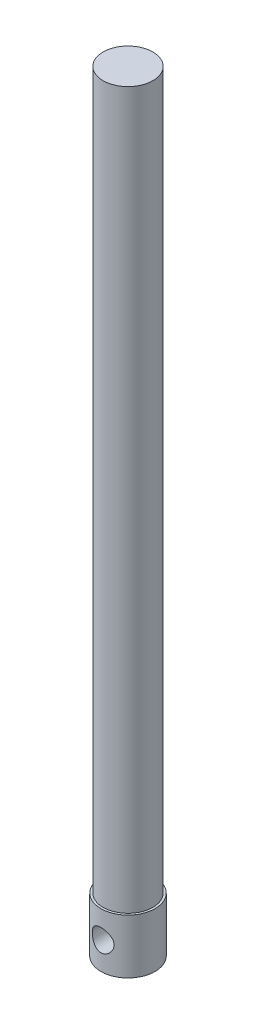
ISO-10303-21;
HEADER;
FILE_DESCRIPTION(('STEP AP214'),'2;1');
FILE_NAME('part.step','',(''),(''),'','','');
FILE_SCHEMA(('AUTOMOTIVE_DESIGN { 1 0 10303 214 1 1 1 1 }'));
ENDSEC;
DATA;
#1=APPLICATION_CONTEXT('core data for automotive mechanical design processes');
#2=APPLICATION_PROTOCOL_DEFINITION('international standard','automotive_design',2000,#1);
#3=PRODUCT_CONTEXT('',#1,'mechanical');
#4=PRODUCT('Part','Part','',(#3));
#5=PRODUCT_RELATED_PRODUCT_CATEGORY('part','',(#4));
#6=PRODUCT_DEFINITION_FORMATION('','',#4);
#7=PRODUCT_DEFINITION_CONTEXT('part definition',#1,'design');
#8=PRODUCT_DEFINITION('design','',#6,#7);
#9=PRODUCT_DEFINITION_SHAPE('','',#8);
#10=(LENGTH_UNIT() NAMED_UNIT(*) SI_UNIT(.MILLI.,.METRE.));
#11=(NAMED_UNIT(*) PLANE_ANGLE_UNIT() SI_UNIT($,.RADIAN.));
#12=(NAMED_UNIT(*) SI_UNIT($,.STERADIAN.) SOLID_ANGLE_UNIT());
#13=UNCERTAINTY_MEASURE_WITH_UNIT(LENGTH_MEASURE(1.E-05),#10,'distance_accuracy_value','');
#14=(GEOMETRIC_REPRESENTATION_CONTEXT(3) GLOBAL_UNCERTAINTY_ASSIGNED_CONTEXT((#13)) GLOBAL_UNIT_ASSIGNED_CONTEXT((#10,
#11,#12)) REPRESENTATION_CONTEXT('',''));
#15=CARTESIAN_POINT('',(0.,0.,0.));
#16=DIRECTION('',(0.,0.,1.));
#17=DIRECTION('',(1.,0.,0.));
#18=AXIS2_PLACEMENT_3D('',#15,#16,#17);
#19=CARTESIAN_POINT('',(0.,7.9248,0.));
#20=DIRECTION('',(0.,-1.,0.));
#21=DIRECTION('',(0.,0.,-1.));
#22=AXIS2_PLACEMENT_3D('',#19,#20,#21);
#23=CYLINDRICAL_SURFACE('',#22,3.937);
#24=CARTESIAN_POINT('',(0.,5.5499,-3.937));
#25=CARTESIAN_POINT('',(-0.0852678718735289,5.54989188166266,-3.93699397530778));
#26=CARTESIAN_POINT('',(-0.170681186016788,5.5429891777963,-3.93419747755761));
#27=CARTESIAN_POINT('',(-0.33909770118889,5.51561851436593,-3.92328314264274));
#28=CARTESIAN_POINT('',(-0.42209376659667,5.49511395230236,-3.91515094780274));
#29=CARTESIAN_POINT('',(-0.582967419371479,5.44140932806507,-3.89444110925143));
#30=CARTESIAN_POINT('',(-0.660860896664724,5.40825111152438,-3.88187812842009));
#31=CARTESIAN_POINT('',(-0.809907949645861,5.33034774353847,-3.85354138152557));
#32=CARTESIAN_POINT('',(-0.881063796538838,5.28560651576735,-3.83776870311415));
#33=CARTESIAN_POINT('',(-1.01811488369547,5.18355165918332,-3.80376291932802));
#34=CARTESIAN_POINT('',(-1.08364660622276,5.12577576469848,-3.78545262774408));
#35=CARTESIAN_POINT('',(-1.20439899386649,5.00026759681028,-3.74878411792123));
#36=CARTESIAN_POINT('',(-1.2596145426701,4.93253041270259,-3.73042588045579));
#37=CARTESIAN_POINT('',(-1.36063703990203,4.78528993682057,-3.69481241846338));
#38=CARTESIAN_POINT('',(-1.4059031779247,4.70539213862023,-3.67764508153896));
#39=CARTESIAN_POINT('',(-1.48219167293576,4.53832148321763,-3.64757055515181));
#40=CARTESIAN_POINT('',(-1.51322090469863,4.45115216140157,-3.63466131037277));
#41=CARTESIAN_POINT('',(-1.55867864700196,4.27619153134953,-3.61539454076224));
#42=CARTESIAN_POINT('',(-1.57380383121697,4.18861246743793,-3.60876346071988));
#43=CARTESIAN_POINT('',(-1.58919986610244,4.01192766295402,-3.6020120595165));
#44=CARTESIAN_POINT('',(-1.5894781854525,3.92282271254287,-3.60188846478109));
#45=CARTESIAN_POINT('',(-1.57569993404234,3.75235603460881,-3.60793299076725));
#46=CARTESIAN_POINT('',(-1.56265867393107,3.6708933515412,-3.61365548951523));
#47=CARTESIAN_POINT('',(-1.52430630590652,3.51142956852914,-3.62999850760419));
#48=CARTESIAN_POINT('',(-1.49899301834979,3.43342908619594,-3.64061989702431));
#49=CARTESIAN_POINT('',(-1.43633074058258,3.28120465255449,-3.66579855551919));
#50=CARTESIAN_POINT('',(-1.39874471444826,3.20709149787132,-3.68043234626656));
#51=CARTESIAN_POINT('',(-1.31277051629283,3.06594878667293,-3.71196653031757));
#52=CARTESIAN_POINT('',(-1.26437824647278,2.99892193157385,-3.72886778248439));
#53=CARTESIAN_POINT('',(-1.15369164779308,2.86830556168193,-3.76465157389743));
#54=CARTESIAN_POINT('',(-1.09060315834836,2.80540125366678,-3.7835853814149));
#55=CARTESIAN_POINT('',(-0.954573465540228,2.69084411908779,-3.82017214862093));
#56=CARTESIAN_POINT('',(-0.881630241150248,2.63919360616416,-3.83782484443231));
#57=CARTESIAN_POINT('',(-0.725991729858424,2.54769118388864,-3.87031564355391));
#58=CARTESIAN_POINT('',(-0.643128060194638,2.50810104396741,-3.88508908881623));
#59=CARTESIAN_POINT('',(-0.471169838068137,2.44365923129683,-3.90966659782024));
#60=CARTESIAN_POINT('',(-0.382078530545697,2.41879994602549,-3.91947322790127));
#61=CARTESIAN_POINT('',(-0.205934217498666,2.38592049622187,-3.93254220637116));
#62=CARTESIAN_POINT('',(-0.119079477957163,2.37697974152315,-3.9361618056611));
#63=CARTESIAN_POINT('',(0.0549565629770295,2.37346784352023,-3.93757709371327));
#64=CARTESIAN_POINT('',(0.142137771934859,2.37889290073989,-3.93537432237887));
#65=CARTESIAN_POINT('',(0.310152972302367,2.40328504843925,-3.9256258413736));
#66=CARTESIAN_POINT('',(0.391094763287072,2.42162029260827,-3.91832955422942));
#67=CARTESIAN_POINT('',(0.548675769925282,2.47044886775443,-3.89938797371888));
#68=CARTESIAN_POINT('',(0.625314432971595,2.50094375621635,-3.88774212324484));
#69=CARTESIAN_POINT('',(0.774762631399737,2.57422193903061,-3.86078455963164));
#70=CARTESIAN_POINT('',(0.847382373737359,2.61735375565419,-3.84537127796092));
#71=CARTESIAN_POINT('',(0.984609551220385,2.71429553688,-3.81254499172692));
#72=CARTESIAN_POINT('',(1.04921372983476,2.76810981857636,-3.79513117989386));
#73=CARTESIAN_POINT('',(1.17312319784573,2.88911991211552,-3.7587494391048));
#74=CARTESIAN_POINT('',(1.23178247919758,2.95697114454591,-3.73975560937828));
#75=CARTESIAN_POINT('',(1.33704509659372,3.10188408509098,-3.70342925270504));
#76=CARTESIAN_POINT('',(1.38364631025878,3.17894741117074,-3.68609701855858));
#77=CARTESIAN_POINT('',(1.46380244365541,3.34133794788632,-3.65501406824621));
#78=CARTESIAN_POINT('',(1.49721504979523,3.42674352295765,-3.64130292227123));
#79=CARTESIAN_POINT('',(1.54892083263561,3.60268995631373,-3.61961521268402));
#80=CARTESIAN_POINT('',(1.56722541508174,3.6932268854148,-3.61163432362917));
#81=CARTESIAN_POINT('',(1.58709752433475,3.86974934389262,-3.6029428507049));
#82=CARTESIAN_POINT('',(1.58978855561481,3.95558511940128,-3.6017443926454));
#83=CARTESIAN_POINT('',(1.58131687444804,4.12642605117492,-3.60547187658093));
#84=CARTESIAN_POINT('',(1.57015598630134,4.2114313153325,-3.61039701209781));
#85=CARTESIAN_POINT('',(1.53521999742678,4.37463754063522,-3.62538335484292));
#86=CARTESIAN_POINT('',(1.51197863803536,4.45297460915314,-3.63522660597022));
#87=CARTESIAN_POINT('',(1.45404501021981,4.6046663860248,-3.65878324575863));
#88=CARTESIAN_POINT('',(1.4193495682903,4.67801970676589,-3.67249770683692));
#89=CARTESIAN_POINT('',(1.33717553842431,4.82228535795487,-3.70323620473233));
#90=CARTESIAN_POINT('',(1.28907368006759,4.89281114329406,-3.72040577940556));
#91=CARTESIAN_POINT('',(1.18235594787364,5.02514228703555,-3.75568354538941));
#92=CARTESIAN_POINT('',(1.12373681185846,5.08694492909537,-3.77379202668112));
#93=CARTESIAN_POINT('',(0.993021926622907,5.20428462587468,-3.8103510700852));
#94=CARTESIAN_POINT('',(0.920290138122343,5.25913407071088,-3.82874463652332));
#95=CARTESIAN_POINT('',(0.765960087959823,5.35586762625763,-3.86257749733874));
#96=CARTESIAN_POINT('',(0.684357747030008,5.39774573752282,-3.87801542342914));
#97=CARTESIAN_POINT('',(0.516059064950645,5.46637852171371,-3.90394305894552));
#98=CARTESIAN_POINT('',(0.42948305533229,5.4933955647764,-3.91451803326074));
#99=CARTESIAN_POINT('',(0.252666162978104,5.53225878529893,-3.92987797755318));
#100=CARTESIAN_POINT('',(0.162437825144309,5.54415298667762,-3.93468127332258));
#101=CARTESIAN_POINT('',(0.0479957238914644,5.54935819556165,-3.93678225539309));
#102=CARTESIAN_POINT('',(0.0240036248772934,5.54990228538041,-3.93700169600166));
#103=CARTESIAN_POINT('',(0.,5.5499,-3.937));
#104=B_SPLINE_CURVE_WITH_KNOTS('',3,(#24,#25,#26,#27,#28,#29,#30,#31,#32,#33,#34,#35,#36,#37,
#38,#39,#40,#41,#42,#43,#44,#45,#46,#47,#48,#49,#50,#51,#52,#53,#54,#55,#56,#57,#58,#59,#60,#61,
#62,#63,#64,#65,#66,#67,#68,#69,#70,#71,#72,#73,#74,#75,#76,#77,#78,#79,#80,#81,#82,#83,#84,#85,
#86,#87,#88,#89,#90,#91,#92,#93,#94,#95,#96,#97,#98,#99,#100,#101,#102,#103),.UNSPECIFIED.,.T.,
.F.,(4,2,2,2,2,2,2,2,2,2,2,2,2,2,2,2,2,2,2,2,2,2,2,2,2,2,2,2,2,2,2,2,2,2,2,2,2,2,2,4),(0.,
0.255738670033466,0.512168337899322,0.767757240312033,1.02325967657718,1.28987728759337,
1.55662677880292,1.83548395698789,2.11420633741349,2.38013387564254,2.64592763840206,
2.8928698183935,3.13985587403686,3.39192630149493,3.64409247853607,3.91609592121501,
4.188155231762,4.46575639383451,4.74321397346625,5.00402937757958,5.26477580801213,
5.51357556897744,5.76240720804434,6.01887820150572,6.27545305412645,6.54923632852548,
6.8230677596678,7.09977812491642,7.37627939714436,7.63261092751838,7.88890870256867,
8.13474000437026,8.38063947423409,8.64076080662814,8.90096296161883,9.17842616602315,
9.45601751054339,9.72853637215364,10.000187646764,10.0721802386655),.UNSPECIFIED.);
#105=CARTESIAN_POINT('',(0.,5.5499,-3.937));
#106=VERTEX_POINT('',#105);
#107=EDGE_CURVE('E10',#106,#106,#104,.T.);
#108=ORIENTED_EDGE('',*,*,#107,.T.);
#109=EDGE_LOOP('',(#108));
#110=FACE_BOUND('',#109,.T.);
#111=CARTESIAN_POINT('',(1.5875,3.9624,3.60275071993609));
#112=CARTESIAN_POINT('',(1.58749178763547,3.87745184968692,3.60275845942473));
#113=CARTESIAN_POINT('',(1.58063852001494,3.7923541932734,3.60579861608159));
#114=CARTESIAN_POINT('',(1.5534827380465,3.62459826994222,3.61757731634515));
#115=CARTESIAN_POINT('',(1.53314266307899,3.54194749101442,3.62633177315457));
#116=CARTESIAN_POINT('',(1.47991792306788,3.38180753602768,3.64837385444683));
#117=CARTESIAN_POINT('',(1.44708218875387,3.30429959446339,3.66164377600924));
#118=CARTESIAN_POINT('',(1.36994114821069,3.15591701237583,3.69119618758357));
#119=CARTESIAN_POINT('',(1.32563906375286,3.08504051617825,3.7074778310073));
#120=CARTESIAN_POINT('',(1.22406482464954,2.94776208025523,3.74228008944031));
#121=CARTESIAN_POINT('',(1.16623175631337,2.88179341443741,3.76087350650342));
#122=CARTESIAN_POINT('',(1.04041666839644,2.76017331703126,3.7976037692042));
#123=CARTESIAN_POINT('',(0.972430894829154,2.70452571881734,3.8157404430489));
#124=CARTESIAN_POINT('',(0.824884891860633,2.60296784290904,3.85038896630145));
#125=CARTESIAN_POINT('',(0.744969428817602,2.55753848833474,3.86680628490598));
#126=CARTESIAN_POINT('',(0.577850095564363,2.48095357355212,3.89528264269942));
#127=CARTESIAN_POINT('',(0.490649284536451,2.44979205741931,3.90734349999203));
#128=CARTESIAN_POINT('',(0.315976909654143,2.40417746118668,3.92523268915501));
#129=CARTESIAN_POINT('',(0.22872893113434,2.38897901820088,3.93133799974843));
#130=CARTESIAN_POINT('',(0.0527216337222548,2.37332029645772,3.93763026730477));
#131=CARTESIAN_POINT('',(-0.0360371002248951,2.37285443771588,3.93781946500245));
#132=CARTESIAN_POINT('',(-0.207152347591184,2.38626892738916,3.93242568817177));
#133=CARTESIAN_POINT('',(-0.289585173667811,2.39933214625649,3.92717147860551));
#134=CARTESIAN_POINT('',(-0.45097321947176,2.43804202197494,3.91192599925903));
#135=CARTESIAN_POINT('',(-0.529928183423092,2.46368960265248,3.90193438170434));
#136=CARTESIAN_POINT('',(-0.683547833867494,2.52715358114754,3.87799836176374));
#137=CARTESIAN_POINT('',(-0.758129615372151,2.56514808376368,3.86399648528839));
#138=CARTESIAN_POINT('',(-0.90005197387124,2.65205910693941,3.83342579901462));
#139=CARTESIAN_POINT('',(-0.967390040687501,2.70097939568288,3.81685610420881));
#140=CARTESIAN_POINT('',(-1.09767458622258,2.81214827824594,3.78152551524497));
#141=CARTESIAN_POINT('',(-1.1600300775633,2.87506745936287,3.76269218288103));
#142=CARTESIAN_POINT('',(-1.27354920654719,3.01053738815097,3.72580351888211));
#143=CARTESIAN_POINT('',(-1.32470905957345,3.08309137953397,3.70774845198617));
#144=CARTESIAN_POINT('',(-1.41576747597965,3.23845575809673,3.67396318767703));
#145=CARTESIAN_POINT('',(-1.45529496871041,3.32150318578171,3.65831594371394));
#146=CARTESIAN_POINT('',(-1.51956761869431,3.49387462094644,3.6320934134754));
#147=CARTESIAN_POINT('',(-1.54432256167992,3.5831944294998,3.62151477054047));
#148=CARTESIAN_POINT('',(-1.5768973171595,3.75967416441007,3.60744527968175));
#149=CARTESIAN_POINT('',(-1.58566970684194,3.84662609759224,3.60355658711671));
#150=CARTESIAN_POINT('',(-1.58881236242541,4.02082762643945,3.60217304906533));
#151=CARTESIAN_POINT('',(-1.58318710782278,4.10807712108998,3.60467621489849));
#152=CARTESIAN_POINT('',(-1.55856187525977,4.2750491883417,3.61538551263529));
#153=CARTESIAN_POINT('',(-1.54036042061135,4.3549140936465,3.62325080004836));
#154=CARTESIAN_POINT('',(-1.49213960377955,4.51040097994732,3.64337287312496));
#155=CARTESIAN_POINT('',(-1.46211759404646,4.5860220060675,3.65563064255452));
#156=CARTESIAN_POINT('',(-1.38973797118339,4.73432661171403,3.68376972338381));
#157=CARTESIAN_POINT('',(-1.34692586804197,4.80676337924196,3.69977878179194));
#158=CARTESIAN_POINT('',(-1.2506435497085,4.94375788219363,3.73342437144332));
#159=CARTESIAN_POINT('',(-1.19716894100472,5.00831235195861,3.75106157195235));
#160=CARTESIAN_POINT('',(-1.07632786899079,5.13276298796025,3.78757942937396));
#161=CARTESIAN_POINT('',(-1.00821861540193,5.19194250334755,3.80645372868187));
#162=CARTESIAN_POINT('',(-0.862587610422444,5.29814677182846,3.84207293106277));
#163=CARTESIAN_POINT('',(-0.785065418364279,5.34517095554643,3.85881773436804));
#164=CARTESIAN_POINT('',(-0.622486311607108,5.42557759028357,3.88835427375229));
#165=CARTESIAN_POINT('',(-0.537427447825255,5.45895649985214,3.90114498338879));
#166=CARTESIAN_POINT('',(-0.362258090330949,5.51070654213748,3.92128698847813));
#167=CARTESIAN_POINT('',(-0.272150420729258,5.52908597717795,3.92864129281014));
#168=CARTESIAN_POINT('',(-0.0958700181820041,5.54931866568682,3.93675586096546));
#169=CARTESIAN_POINT('',(-0.0098312430270741,5.55218462799694,3.93792011035525));
#170=CARTESIAN_POINT('',(0.161461368639591,5.54399256589429,3.93461977879785));
#171=CARTESIAN_POINT('',(0.246715325737904,5.53293671777781,3.93015607762747));
#172=CARTESIAN_POINT('',(0.411252760990064,5.49793957567023,3.91630556838212));
#173=CARTESIAN_POINT('',(0.490639780260941,5.4744166225245,3.90707883405792));
#174=CARTESIAN_POINT('',(0.644323839400688,5.4155954413209,3.88469462163496));
#175=CARTESIAN_POINT('',(0.718619879007076,5.38029490718518,3.87153637378941));
#176=CARTESIAN_POINT('',(0.863642724602975,5.29715533794631,3.84185015185363));
#177=CARTESIAN_POINT('',(0.934064137291003,5.24882876273093,3.82519840308557));
#178=CARTESIAN_POINT('',(1.06609026510051,5.14173833293566,3.79052601239922));
#179=CARTESIAN_POINT('',(1.12769196575622,5.0829709251174,3.77250490565786));
#180=CARTESIAN_POINT('',(1.24435196645252,4.9522937039382,3.73571045110421));
#181=CARTESIAN_POINT('',(1.2987544287718,4.87978952563881,3.71696114306417));
#182=CARTESIAN_POINT('',(1.39469495913414,4.72606829335838,3.68203922354503));
#183=CARTESIAN_POINT('',(1.43622605865285,4.6448465516329,3.66586801013252));
#184=CARTESIAN_POINT('',(1.50465979814231,4.47653857319971,3.63831341836822));
#185=CARTESIAN_POINT('',(1.53168842887391,4.38951048406006,3.626889004974));
#186=CARTESIAN_POINT('',(1.57042088898303,4.21170882239398,3.61029232773968));
#187=CARTESIAN_POINT('',(1.58217613689346,4.12094888366665,3.60509909090494));
#188=CARTESIAN_POINT('',(1.58702266951787,4.0074585024354,3.60296000540614));
#189=CARTESIAN_POINT('',(1.58750217852447,3.98493451160069,3.60274866685317));
#190=CARTESIAN_POINT('',(1.5875,3.9624,3.60275071993609));
#191=B_SPLINE_CURVE_WITH_KNOTS('',3,(#111,#112,#113,#114,#115,#116,#117,#118,#119,#120,#121,
#122,#123,#124,#125,#126,#127,#128,#129,#130,#131,#132,#133,#134,#135,#136,#137,#138,#139,#140,
#141,#142,#143,#144,#145,#146,#147,#148,#149,#150,#151,#152,#153,#154,#155,#156,#157,#158,#159,
#160,#161,#162,#163,#164,#165,#166,#167,#168,#169,#170,#171,#172,#173,#174,#175,#176,#177,#178,
#179,#180,#181,#182,#183,#184,#185,#186,#187,#188,#189,#190),.UNSPECIFIED.,.T.,.F.,(4,2,2,2,2,2,
2,2,2,2,2,2,2,2,2,2,2,2,2,2,2,2,2,2,2,2,2,2,2,2,2,2,2,2,2,2,2,2,2,4),(0.,0.254783301464325,
0.510279168958892,0.76478468776861,1.01921877407232,1.28707474321938,1.55502999909064,
1.83374864760679,2.1123508423183,2.37727156320972,2.64209194384868,2.89180071510769,
3.14152782039813,3.39503026666878,3.64862027853949,3.91909607442705,4.18966316224253,
4.46810459685886,4.74636137907509,5.00741123892148,5.26837988897344,5.51414044063898,
5.75995606871595,6.01583015792895,6.27180989938775,6.54706226186526,6.82232751527818,
7.09766416486318,7.3728483099489,7.62983044760152,7.88677241807518,8.13559273686044,
8.38446180386544,8.64439179381433,8.90441041353349,9.18079395818533,9.45732687586892,
9.73141682179601,10.0045816200069,10.0721689334604),.UNSPECIFIED.);
#192=CARTESIAN_POINT('',(1.5875,3.9624,3.60275071993609));
#193=VERTEX_POINT('',#192);
#194=EDGE_CURVE('E50',#193,#193,#191,.T.);
#195=ORIENTED_EDGE('',*,*,#194,.T.);
#196=EDGE_LOOP('',(#195));
#197=FACE_BOUND('',#196,.T.);
#198=CARTESIAN_POINT('',(0.,7.9248,0.));
#199=DIRECTION('',(0.,1.,0.));
#200=DIRECTION('',(0.,0.,1.));
#201=AXIS2_PLACEMENT_3D('',#198,#199,#200);
#202=CIRCLE('',#201,3.937);
#203=CARTESIAN_POINT('',(0.,7.9248,3.937));
#204=VERTEX_POINT('',#203);
#205=EDGE_CURVE('E58',#204,#204,#202,.T.);
#206=ORIENTED_EDGE('',*,*,#205,.F.);
#207=EDGE_LOOP('',(#206));
#208=FACE_BOUND('',#207,.T.);
#209=CARTESIAN_POINT('',(0.,0.,0.));
#210=DIRECTION('',(0.,1.,0.));
#211=DIRECTION('',(0.,0.,1.));
#212=AXIS2_PLACEMENT_3D('',#209,#210,#211);
#213=CIRCLE('',#212,3.937);
#214=CARTESIAN_POINT('',(0.,0.,3.937));
#215=VERTEX_POINT('',#214);
#216=EDGE_CURVE('E64',#215,#215,#213,.T.);
#217=ORIENTED_EDGE('',*,*,#216,.T.);
#218=EDGE_LOOP('',(#217));
#219=FACE_BOUND('',#218,.T.);
#220=ADVANCED_FACE('F39',(#110,#197,#208,#219),#23,.T.);
#221=CARTESIAN_POINT('',(0.,7.9248,0.));
#222=DIRECTION('',(0.,1.,0.));
#223=DIRECTION('',(0.,0.,1.));
#224=AXIS2_PLACEMENT_3D('',#221,#222,#223);
#225=PLANE('',#224);
#226=CARTESIAN_POINT('',(0.,7.9248,0.));
#227=DIRECTION('',(0.,1.,0.));
#228=DIRECTION('',(0.,0.,1.));
#229=AXIS2_PLACEMENT_3D('',#226,#227,#228);
#230=CIRCLE('',#229,3.6195);
#231=CARTESIAN_POINT('',(0.,7.9248,3.6195));
#232=VERTEX_POINT('',#231);
#233=EDGE_CURVE('E54',#232,#232,#230,.T.);
#234=ORIENTED_EDGE('',*,*,#233,.F.);
#235=EDGE_LOOP('',(#234));
#236=FACE_BOUND('',#235,.T.);
#237=ORIENTED_EDGE('',*,*,#205,.T.);
#238=EDGE_LOOP('',(#237));
#239=FACE_BOUND('',#238,.T.);
#240=ADVANCED_FACE('F81',(#236,#239),#225,.T.);
#241=CARTESIAN_POINT('',(0.,0.,0.));
#242=DIRECTION('',(0.,1.,0.));
#243=DIRECTION('',(0.,0.,1.));
#244=AXIS2_PLACEMENT_3D('',#241,#242,#243);
#245=PLANE('',#244);
#246=ORIENTED_EDGE('',*,*,#216,.F.);
#247=EDGE_LOOP('',(#246));
#248=FACE_BOUND('',#247,.T.);
#249=ADVANCED_FACE('F79',(#248),#245,.F.);
#250=CARTESIAN_POINT('',(0.,112.0648,0.));
#251=DIRECTION('',(0.,-1.,0.));
#252=DIRECTION('',(0.,0.,-1.));
#253=AXIS2_PLACEMENT_3D('',#250,#251,#252);
#254=CYLINDRICAL_SURFACE('',#253,3.6195);
#255=CARTESIAN_POINT('',(0.,112.0648,0.));
#256=DIRECTION('',(0.,1.,0.));
#257=DIRECTION('',(0.,0.,1.));
#258=AXIS2_PLACEMENT_3D('',#255,#256,#257);
#259=CIRCLE('',#258,3.6195);
#260=CARTESIAN_POINT('',(0.,112.0648,3.6195));
#261=VERTEX_POINT('',#260);
#262=EDGE_CURVE('E97',#261,#261,#259,.T.);
#263=ORIENTED_EDGE('',*,*,#262,.F.);
#264=EDGE_LOOP('',(#263));
#265=FACE_BOUND('',#264,.T.);
#266=ORIENTED_EDGE('',*,*,#233,.T.);
#267=EDGE_LOOP('',(#266));
#268=FACE_BOUND('',#267,.T.);
#269=ADVANCED_FACE('F75',(#265,#268),#254,.T.);
#270=CARTESIAN_POINT('',(0.,112.0648,0.));
#271=DIRECTION('',(0.,1.,0.));
#272=DIRECTION('',(0.,0.,1.));
#273=AXIS2_PLACEMENT_3D('',#270,#271,#272);
#274=PLANE('',#273);
#275=ORIENTED_EDGE('',*,*,#262,.T.);
#276=EDGE_LOOP('',(#275));
#277=FACE_BOUND('',#276,.T.);
#278=ADVANCED_FACE('F70',(#277),#274,.T.);
#279=CARTESIAN_POINT('',(0.,3.9624,-3.937));
#280=DIRECTION('',(0.,0.,1.));
#281=DIRECTION('',(1.,0.,0.));
#282=AXIS2_PLACEMENT_3D('',#279,#280,#281);
#283=CYLINDRICAL_SURFACE('',#282,1.5875);
#284=ORIENTED_EDGE('',*,*,#194,.F.);
#285=EDGE_LOOP('',(#284));
#286=FACE_BOUND('',#285,.T.);
#287=ORIENTED_EDGE('',*,*,#107,.F.);
#288=EDGE_LOOP('',(#287));
#289=FACE_BOUND('',#288,.T.);
#290=ADVANCED_FACE('F66',(#286,#289),#283,.F.);
#291=CLOSED_SHELL('',(#220,#240,#249,#269,#278,#290));
#292=MANIFOLD_SOLID_BREP('B2',#291);
#293=ADVANCED_BREP_SHAPE_REPRESENTATION('',(#18,#292),#14);
#294=SHAPE_DEFINITION_REPRESENTATION(#9,#293);
ENDSEC;
END-ISO-10303-21;
